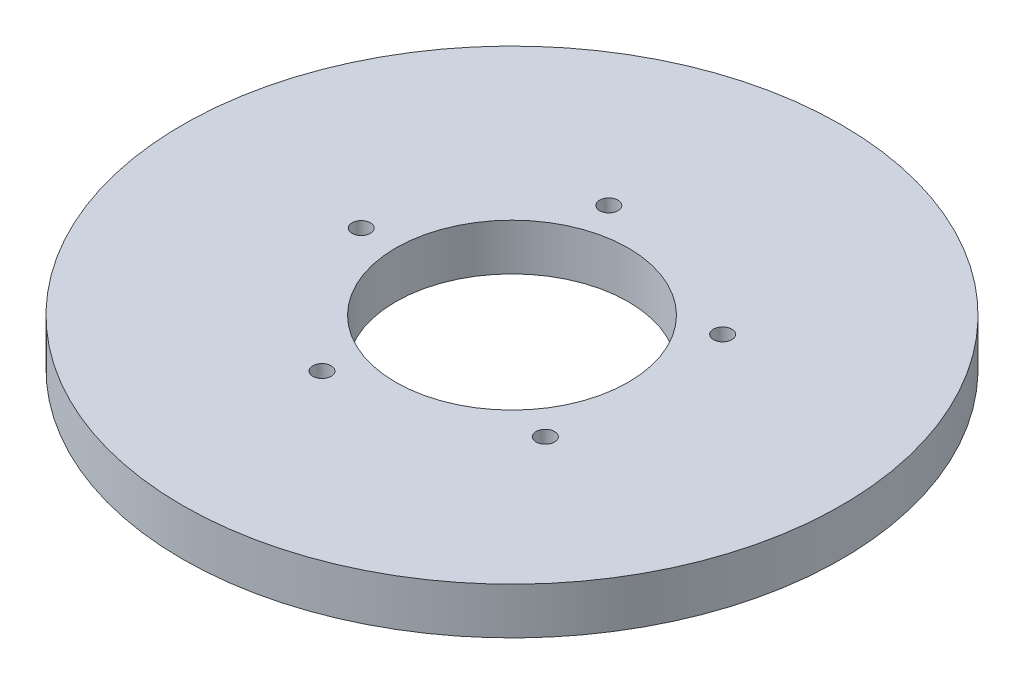
ISO-10303-21;
HEADER;
FILE_DESCRIPTION(('STEP AP214'),'2;1');
FILE_NAME('part.step','',(''),(''),'','','');
FILE_SCHEMA(('AUTOMOTIVE_DESIGN { 1 0 10303 214 1 1 1 1 }'));
ENDSEC;
DATA;
#1=APPLICATION_CONTEXT('core data for automotive mechanical design processes');
#2=APPLICATION_PROTOCOL_DEFINITION('international standard','automotive_design',2000,#1);
#3=PRODUCT_CONTEXT('',#1,'mechanical');
#4=PRODUCT('Part','Part','',(#3));
#5=PRODUCT_RELATED_PRODUCT_CATEGORY('part','',(#4));
#6=PRODUCT_DEFINITION_FORMATION('','',#4);
#7=PRODUCT_DEFINITION_CONTEXT('part definition',#1,'design');
#8=PRODUCT_DEFINITION('design','',#6,#7);
#9=PRODUCT_DEFINITION_SHAPE('','',#8);
#10=(LENGTH_UNIT() NAMED_UNIT(*) SI_UNIT(.MILLI.,.METRE.));
#11=(NAMED_UNIT(*) PLANE_ANGLE_UNIT() SI_UNIT($,.RADIAN.));
#12=(NAMED_UNIT(*) SI_UNIT($,.STERADIAN.) SOLID_ANGLE_UNIT());
#13=UNCERTAINTY_MEASURE_WITH_UNIT(LENGTH_MEASURE(1.E-05),#10,'distance_accuracy_value','');
#14=(GEOMETRIC_REPRESENTATION_CONTEXT(3) GLOBAL_UNCERTAINTY_ASSIGNED_CONTEXT((#13)) GLOBAL_UNIT_ASSIGNED_CONTEXT((#10,
#11,#12)) REPRESENTATION_CONTEXT('',''));
#15=CARTESIAN_POINT('',(0.,0.,0.));
#16=DIRECTION('',(0.,0.,1.));
#17=DIRECTION('',(1.,0.,0.));
#18=AXIS2_PLACEMENT_3D('',#15,#16,#17);
#19=CARTESIAN_POINT('',(0.,12.,0.));
#20=DIRECTION('',(0.,-1.,0.));
#21=DIRECTION('',(0.,0.,-1.));
#22=AXIS2_PLACEMENT_3D('',#19,#20,#21);
#23=CYLINDRICAL_SURFACE('',#22,85.);
#24=CARTESIAN_POINT('',(0.,12.,0.));
#25=DIRECTION('',(0.,1.,0.));
#26=DIRECTION('',(0.,0.,1.));
#27=AXIS2_PLACEMENT_3D('',#24,#25,#26);
#28=CIRCLE('',#27,85.);
#29=CARTESIAN_POINT('',(0.,12.,85.));
#30=VERTEX_POINT('',#29);
#31=EDGE_CURVE('E10',#30,#30,#28,.T.);
#32=ORIENTED_EDGE('',*,*,#31,.F.);
#33=EDGE_LOOP('',(#32));
#34=FACE_BOUND('',#33,.T.);
#35=CARTESIAN_POINT('',(0.,0.,0.));
#36=DIRECTION('',(0.,1.,0.));
#37=DIRECTION('',(0.,0.,1.));
#38=AXIS2_PLACEMENT_3D('',#35,#36,#37);
#39=CIRCLE('',#38,85.);
#40=CARTESIAN_POINT('',(0.,0.,85.));
#41=VERTEX_POINT('',#40);
#42=EDGE_CURVE('E37',#41,#41,#39,.T.);
#43=ORIENTED_EDGE('',*,*,#42,.T.);
#44=EDGE_LOOP('',(#43));
#45=FACE_BOUND('',#44,.T.);
#46=ADVANCED_FACE('F40',(#34,#45),#23,.T.);
#47=CARTESIAN_POINT('',(0.,12.,0.));
#48=DIRECTION('',(0.,1.,0.));
#49=DIRECTION('',(0.,0.,1.));
#50=AXIS2_PLACEMENT_3D('',#47,#48,#49);
#51=PLANE('',#50);
#52=CARTESIAN_POINT('',(-12.0194048314296,12.,36.991924376336));
#53=DIRECTION('',(0.,1.,0.));
#54=DIRECTION('',(0.951056516295155,0.,0.309016994374945));
#55=AXIS2_PLACEMENT_3D('',#52,#53,#54);
#56=CIRCLE('',#55,2.36613746091851);
#57=CARTESIAN_POINT('',(-9.76907438077301,12.,37.723101062787));
#58=VERTEX_POINT('',#57);
#59=EDGE_CURVE('E78',#58,#58,#56,.T.);
#60=ORIENTED_EDGE('',*,*,#59,.F.);
#61=EDGE_LOOP('',(#60));
#62=FACE_BOUND('',#61,.T.);
#63=CARTESIAN_POINT('',(31.4672103732279,12.,22.8622665738412));
#64=DIRECTION('',(0.,1.,0.));
#65=DIRECTION('',(0.587785252292469,0.,-0.809016994374951));
#66=AXIS2_PLACEMENT_3D('',#63,#64,#65);
#67=CIRCLE('',#66,2.36613746091851);
#68=CARTESIAN_POINT('',(32.8579910776525,12.,20.948021156931));
#69=VERTEX_POINT('',#68);
#70=EDGE_CURVE('E71',#69,#69,#67,.T.);
#71=ORIENTED_EDGE('',*,*,#70,.F.);
#72=EDGE_LOOP('',(#71));
#73=FACE_BOUND('',#72,.T.);
#74=CARTESIAN_POINT('',(31.4672103732275,12.,-22.8622665738417));
#75=DIRECTION('',(0.,1.,0.));
#76=DIRECTION('',(-0.58778525229248,0.,-0.809016994374942));
#77=AXIS2_PLACEMENT_3D('',#74,#75,#76);
#78=CIRCLE('',#77,2.36613746091851);
#79=CARTESIAN_POINT('',(30.0764296688029,12.,-24.7765119907519));
#80=VERTEX_POINT('',#79);
#81=EDGE_CURVE('E70',#80,#80,#78,.T.);
#82=ORIENTED_EDGE('',*,*,#81,.F.);
#83=EDGE_LOOP('',(#82));
#84=FACE_BOUND('',#83,.T.);
#85=CARTESIAN_POINT('',(-12.0194048314302,12.,-36.9919243763359));
#86=DIRECTION('',(0.,1.,0.));
#87=DIRECTION('',(-0.95105651629515,0.,0.309016994374958));
#88=AXIS2_PLACEMENT_3D('',#85,#86,#87);
#89=CIRCLE('',#88,2.36613746091851);
#90=CARTESIAN_POINT('',(-14.2697352820868,12.,-36.2607476898848));
#91=VERTEX_POINT('',#90);
#92=EDGE_CURVE('E61',#91,#91,#89,.T.);
#93=ORIENTED_EDGE('',*,*,#92,.F.);
#94=EDGE_LOOP('',(#93));
#95=FACE_BOUND('',#94,.T.);
#96=CARTESIAN_POINT('',(-38.895611083596,12.,0.));
#97=DIRECTION('',(0.,1.,0.));
#98=DIRECTION('',(0.,0.,1.));
#99=AXIS2_PLACEMENT_3D('',#96,#97,#98);
#100=CIRCLE('',#99,2.36613746091851);
#101=CARTESIAN_POINT('',(-38.895611083596,12.,2.36613746091851));
#102=VERTEX_POINT('',#101);
#103=EDGE_CURVE('E54',#102,#102,#100,.T.);
#104=ORIENTED_EDGE('',*,*,#103,.F.);
#105=EDGE_LOOP('',(#104));
#106=FACE_BOUND('',#105,.T.);
#107=CARTESIAN_POINT('',(0.,12.,0.));
#108=DIRECTION('',(0.,1.,0.));
#109=DIRECTION('',(0.,0.,1.));
#110=AXIS2_PLACEMENT_3D('',#107,#108,#109);
#111=CIRCLE('',#110,30.);
#112=CARTESIAN_POINT('',(0.,12.,30.));
#113=VERTEX_POINT('',#112);
#114=EDGE_CURVE('E50',#113,#113,#111,.T.);
#115=ORIENTED_EDGE('',*,*,#114,.F.);
#116=EDGE_LOOP('',(#115));
#117=FACE_BOUND('',#116,.T.);
#118=ORIENTED_EDGE('',*,*,#31,.T.);
#119=EDGE_LOOP('',(#118));
#120=FACE_BOUND('',#119,.T.);
#121=ADVANCED_FACE('F94',(#62,#73,#84,#95,#106,#117,#120),#51,.T.);
#122=CARTESIAN_POINT('',(0.,0.,0.));
#123=DIRECTION('',(0.,1.,0.));
#124=DIRECTION('',(0.,0.,1.));
#125=AXIS2_PLACEMENT_3D('',#122,#123,#124);
#126=PLANE('',#125);
#127=CARTESIAN_POINT('',(0.,0.,0.));
#128=DIRECTION('',(0.,1.,0.));
#129=DIRECTION('',(0.,0.,1.));
#130=AXIS2_PLACEMENT_3D('',#127,#128,#129);
#131=CIRCLE('',#130,30.);
#132=CARTESIAN_POINT('',(0.,0.,30.));
#133=VERTEX_POINT('',#132);
#134=EDGE_CURVE('E47',#133,#133,#131,.T.);
#135=ORIENTED_EDGE('',*,*,#134,.T.);
#136=EDGE_LOOP('',(#135));
#137=FACE_BOUND('',#136,.T.);
#138=ORIENTED_EDGE('',*,*,#42,.F.);
#139=EDGE_LOOP('',(#138));
#140=FACE_BOUND('',#139,.T.);
#141=ADVANCED_FACE('F100',(#137,#140),#126,.F.);
#142=CARTESIAN_POINT('',(0.,12.,0.));
#143=DIRECTION('',(0.,-1.,0.));
#144=DIRECTION('',(0.,0.,-1.));
#145=AXIS2_PLACEMENT_3D('',#142,#143,#144);
#146=CYLINDRICAL_SURFACE('',#145,30.);
#147=ORIENTED_EDGE('',*,*,#114,.T.);
#148=EDGE_LOOP('',(#147));
#149=FACE_BOUND('',#148,.T.);
#150=ORIENTED_EDGE('',*,*,#134,.F.);
#151=EDGE_LOOP('',(#150));
#152=FACE_BOUND('',#151,.T.);
#153=ADVANCED_FACE('F108',(#149,#152),#146,.F.);
#154=CARTESIAN_POINT('',(-38.895611083596,1.21773838256259,0.));
#155=DIRECTION('',(0.,1.,0.));
#156=DIRECTION('',(0.,0.,1.));
#157=AXIS2_PLACEMENT_3D('',#154,#155,#156);
#158=CYLINDRICAL_SURFACE('',#157,2.36613746091851);
#159=CARTESIAN_POINT('',(-38.895611083596,1.21773838256259,0.));
#160=DIRECTION('',(0.,1.,0.));
#161=DIRECTION('',(0.,0.,1.));
#162=AXIS2_PLACEMENT_3D('',#159,#160,#161);
#163=CIRCLE('',#162,2.36613746091851);
#164=CARTESIAN_POINT('',(-38.895611083596,1.21773838256259,2.36613746091851));
#165=VERTEX_POINT('',#164);
#166=EDGE_CURVE('E55',#165,#165,#163,.T.);
#167=ORIENTED_EDGE('',*,*,#166,.F.);
#168=EDGE_LOOP('',(#167));
#169=FACE_BOUND('',#168,.T.);
#170=ORIENTED_EDGE('',*,*,#103,.T.);
#171=EDGE_LOOP('',(#170));
#172=FACE_BOUND('',#171,.T.);
#173=ADVANCED_FACE('F115',(#169,#172),#158,.F.);
#174=CARTESIAN_POINT('',(-38.895611083596,1.21773838256259,0.));
#175=DIRECTION('',(0.,1.,0.));
#176=DIRECTION('',(0.,0.,1.));
#177=AXIS2_PLACEMENT_3D('',#174,#175,#176);
#178=PLANE('',#177);
#179=ORIENTED_EDGE('',*,*,#166,.T.);
#180=EDGE_LOOP('',(#179));
#181=FACE_BOUND('',#180,.T.);
#182=ADVANCED_FACE('F142',(#181),#178,.T.);
#183=CARTESIAN_POINT('',(-12.0194048314302,1.21773838256259,-36.9919243763359));
#184=DIRECTION('',(0.,1.,0.));
#185=DIRECTION('',(0.,0.,1.));
#186=AXIS2_PLACEMENT_3D('',#183,#184,#185);
#187=CYLINDRICAL_SURFACE('',#186,2.36613746091851);
#188=CARTESIAN_POINT('',(-12.0194048314302,1.21773838256259,-36.9919243763359));
#189=DIRECTION('',(0.,1.,0.));
#190=DIRECTION('',(-0.95105651629515,0.,0.309016994374958));
#191=AXIS2_PLACEMENT_3D('',#188,#189,#190);
#192=CIRCLE('',#191,2.36613746091851);
#193=CARTESIAN_POINT('',(-14.2697352820868,1.21773838256259,-36.2607476898848));
#194=VERTEX_POINT('',#193);
#195=EDGE_CURVE('E63',#194,#194,#192,.T.);
#196=ORIENTED_EDGE('',*,*,#195,.F.);
#197=EDGE_LOOP('',(#196));
#198=FACE_BOUND('',#197,.T.);
#199=ORIENTED_EDGE('',*,*,#92,.T.);
#200=EDGE_LOOP('',(#199));
#201=FACE_BOUND('',#200,.T.);
#202=ADVANCED_FACE('F147',(#198,#201),#187,.F.);
#203=CARTESIAN_POINT('',(-12.0194048314302,1.21773838256259,-36.9919243763359));
#204=DIRECTION('',(0.,1.,0.));
#205=DIRECTION('',(-0.95105651629515,0.,0.309016994374958));
#206=AXIS2_PLACEMENT_3D('',#203,#204,#205);
#207=PLANE('',#206);
#208=ORIENTED_EDGE('',*,*,#195,.T.);
#209=EDGE_LOOP('',(#208));
#210=FACE_BOUND('',#209,.T.);
#211=ADVANCED_FACE('F163',(#210),#207,.T.);
#212=CARTESIAN_POINT('',(31.4672103732275,1.21773838256259,-22.8622665738417));
#213=DIRECTION('',(0.,1.,0.));
#214=DIRECTION('',(0.,0.,1.));
#215=AXIS2_PLACEMENT_3D('',#212,#213,#214);
#216=CYLINDRICAL_SURFACE('',#215,2.36613746091851);
#217=CARTESIAN_POINT('',(31.4672103732275,1.21773838256259,-22.8622665738417));
#218=DIRECTION('',(0.,1.,0.));
#219=DIRECTION('',(-0.58778525229248,0.,-0.809016994374942));
#220=AXIS2_PLACEMENT_3D('',#217,#218,#219);
#221=CIRCLE('',#220,2.36613746091851);
#222=CARTESIAN_POINT('',(30.0764296688029,1.21773838256259,-24.7765119907519));
#223=VERTEX_POINT('',#222);
#224=EDGE_CURVE('E69',#223,#223,#221,.T.);
#225=ORIENTED_EDGE('',*,*,#224,.F.);
#226=EDGE_LOOP('',(#225));
#227=FACE_BOUND('',#226,.T.);
#228=ORIENTED_EDGE('',*,*,#81,.T.);
#229=EDGE_LOOP('',(#228));
#230=FACE_BOUND('',#229,.T.);
#231=ADVANCED_FACE('F172',(#227,#230),#216,.F.);
#232=CARTESIAN_POINT('',(31.4672103732275,1.21773838256259,-22.8622665738417));
#233=DIRECTION('',(0.,1.,0.));
#234=DIRECTION('',(-0.58778525229248,0.,-0.809016994374942));
#235=AXIS2_PLACEMENT_3D('',#232,#233,#234);
#236=PLANE('',#235);
#237=ORIENTED_EDGE('',*,*,#224,.T.);
#238=EDGE_LOOP('',(#237));
#239=FACE_BOUND('',#238,.T.);
#240=ADVANCED_FACE('F185',(#239),#236,.T.);
#241=CARTESIAN_POINT('',(31.4672103732279,1.21773838256259,22.8622665738412));
#242=DIRECTION('',(0.,1.,0.));
#243=DIRECTION('',(0.,0.,1.));
#244=AXIS2_PLACEMENT_3D('',#241,#242,#243);
#245=CYLINDRICAL_SURFACE('',#244,2.36613746091851);
#246=CARTESIAN_POINT('',(31.4672103732279,1.21773838256259,22.8622665738412));
#247=DIRECTION('',(0.,1.,0.));
#248=DIRECTION('',(0.587785252292469,0.,-0.809016994374951));
#249=AXIS2_PLACEMENT_3D('',#246,#247,#248);
#250=CIRCLE('',#249,2.36613746091851);
#251=CARTESIAN_POINT('',(32.8579910776525,1.21773838256259,20.948021156931));
#252=VERTEX_POINT('',#251);
#253=EDGE_CURVE('E76',#252,#252,#250,.T.);
#254=ORIENTED_EDGE('',*,*,#253,.F.);
#255=EDGE_LOOP('',(#254));
#256=FACE_BOUND('',#255,.T.);
#257=ORIENTED_EDGE('',*,*,#70,.T.);
#258=EDGE_LOOP('',(#257));
#259=FACE_BOUND('',#258,.T.);
#260=ADVANCED_FACE('F191',(#256,#259),#245,.F.);
#261=CARTESIAN_POINT('',(31.4672103732279,1.21773838256259,22.8622665738412));
#262=DIRECTION('',(0.,1.,0.));
#263=DIRECTION('',(0.587785252292469,0.,-0.809016994374951));
#264=AXIS2_PLACEMENT_3D('',#261,#262,#263);
#265=PLANE('',#264);
#266=ORIENTED_EDGE('',*,*,#253,.T.);
#267=EDGE_LOOP('',(#266));
#268=FACE_BOUND('',#267,.T.);
#269=ADVANCED_FACE('F89',(#268),#265,.T.);
#270=CARTESIAN_POINT('',(-12.0194048314296,1.21773838256259,36.991924376336));
#271=DIRECTION('',(0.,1.,0.));
#272=DIRECTION('',(0.,0.,1.));
#273=AXIS2_PLACEMENT_3D('',#270,#271,#272);
#274=CYLINDRICAL_SURFACE('',#273,2.36613746091851);
#275=CARTESIAN_POINT('',(-12.0194048314296,1.21773838256259,36.991924376336));
#276=DIRECTION('',(0.,1.,0.));
#277=DIRECTION('',(0.951056516295155,0.,0.309016994374945));
#278=AXIS2_PLACEMENT_3D('',#275,#276,#277);
#279=CIRCLE('',#278,2.36613746091851);
#280=CARTESIAN_POINT('',(-9.76907438077301,1.21773838256259,37.723101062787));
#281=VERTEX_POINT('',#280);
#282=EDGE_CURVE('E59',#281,#281,#279,.T.);
#283=ORIENTED_EDGE('',*,*,#282,.F.);
#284=EDGE_LOOP('',(#283));
#285=FACE_BOUND('',#284,.T.);
#286=ORIENTED_EDGE('',*,*,#59,.T.);
#287=EDGE_LOOP('',(#286));
#288=FACE_BOUND('',#287,.T.);
#289=ADVANCED_FACE('F87',(#285,#288),#274,.F.);
#290=CARTESIAN_POINT('',(-12.0194048314296,1.21773838256259,36.991924376336));
#291=DIRECTION('',(0.,1.,0.));
#292=DIRECTION('',(0.951056516295155,0.,0.309016994374945));
#293=AXIS2_PLACEMENT_3D('',#290,#291,#292);
#294=PLANE('',#293);
#295=ORIENTED_EDGE('',*,*,#282,.T.);
#296=EDGE_LOOP('',(#295));
#297=FACE_BOUND('',#296,.T.);
#298=ADVANCED_FACE('F84',(#297),#294,.T.);
#299=CLOSED_SHELL('',(#46,#121,#141,#153,#173,#182,#202,#211,#231,#240,#260,#269,#289,#298));
#300=MANIFOLD_SOLID_BREP('B2',#299);
#301=ADVANCED_BREP_SHAPE_REPRESENTATION('',(#18,#300),#14);
#302=SHAPE_DEFINITION_REPRESENTATION(#9,#301);
ENDSEC;
END-ISO-10303-21;
